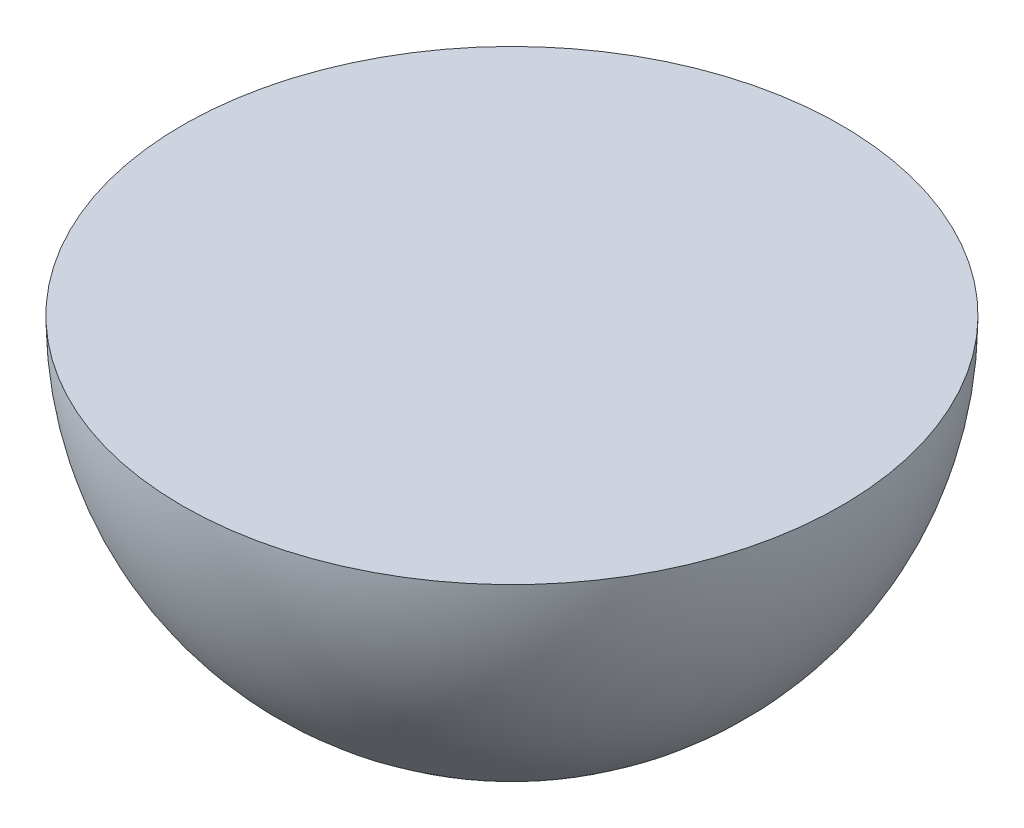
ISO-10303-21;
HEADER;
FILE_DESCRIPTION(('STEP AP214'),'2;1');
FILE_NAME('part.step','',(''),(''),'','','');
FILE_SCHEMA(('AUTOMOTIVE_DESIGN { 1 0 10303 214 1 1 1 1 }'));
ENDSEC;
DATA;
#1=APPLICATION_CONTEXT('core data for automotive mechanical design processes');
#2=APPLICATION_PROTOCOL_DEFINITION('international standard','automotive_design',2000,#1);
#3=PRODUCT_CONTEXT('',#1,'mechanical');
#4=PRODUCT('Part','Part','',(#3));
#5=PRODUCT_RELATED_PRODUCT_CATEGORY('part','',(#4));
#6=PRODUCT_DEFINITION_FORMATION('','',#4);
#7=PRODUCT_DEFINITION_CONTEXT('part definition',#1,'design');
#8=PRODUCT_DEFINITION('design','',#6,#7);
#9=PRODUCT_DEFINITION_SHAPE('','',#8);
#10=(LENGTH_UNIT() NAMED_UNIT(*) SI_UNIT(.MILLI.,.METRE.));
#11=(NAMED_UNIT(*) PLANE_ANGLE_UNIT() SI_UNIT($,.RADIAN.));
#12=(NAMED_UNIT(*) SI_UNIT($,.STERADIAN.) SOLID_ANGLE_UNIT());
#13=UNCERTAINTY_MEASURE_WITH_UNIT(LENGTH_MEASURE(1.E-05),#10,'distance_accuracy_value','');
#14=(GEOMETRIC_REPRESENTATION_CONTEXT(3) GLOBAL_UNCERTAINTY_ASSIGNED_CONTEXT((#13)) GLOBAL_UNIT_ASSIGNED_CONTEXT((#10,
#11,#12)) REPRESENTATION_CONTEXT('',''));
#15=CARTESIAN_POINT('',(0.,0.,0.));
#16=DIRECTION('',(0.,0.,1.));
#17=DIRECTION('',(1.,0.,0.));
#18=AXIS2_PLACEMENT_3D('',#15,#16,#17);
#19=CARTESIAN_POINT('',(0.,0.,0.));
#20=DIRECTION('',(0.,0.,-1.));
#21=DIRECTION('',(-1.,0.,0.));
#22=AXIS2_PLACEMENT_3D('',#19,#20,#21);
#23=SPHERICAL_SURFACE('',#22,71.755);
#24=CARTESIAN_POINT('',(0.,0.,0.));
#25=DIRECTION('',(0.,-1.,0.));
#26=DIRECTION('',(0.,0.,1.));
#27=AXIS2_PLACEMENT_3D('',#24,#25,#26);
#28=SPHERICAL_SURFACE('',#27,71.755);
#29=CARTESIAN_POINT('',(0.,0.,0.));
#30=DIRECTION('',(0.,-1.,0.));
#31=DIRECTION('',(0.,0.,1.));
#32=AXIS2_PLACEMENT_3D('',#29,#30,#31);
#33=CIRCLE('',#32,71.755);
#34=CARTESIAN_POINT('',(0.,0.,71.755));
#35=VERTEX_POINT('',#34);
#36=EDGE_CURVE('E10',#35,#35,#33,.T.);
#37=ORIENTED_EDGE('',*,*,#36,.T.);
#38=EDGE_LOOP('',(#37));
#39=FACE_BOUND('',#38,.T.);
#40=ADVANCED_FACE('F37',(#39),#28,.T.);
#41=CARTESIAN_POINT('',(0.,0.,0.));
#42=DIRECTION('',(0.,-1.,0.));
#43=DIRECTION('',(0.,0.,1.));
#44=AXIS2_PLACEMENT_3D('',#41,#42,#43);
#45=PLANE('',#44);
#46=ORIENTED_EDGE('',*,*,#36,.F.);
#47=EDGE_LOOP('',(#46));
#48=FACE_BOUND('',#47,.T.);
#49=ADVANCED_FACE('F45',(#48),#45,.F.);
#50=CLOSED_SHELL('',(#40,#49));
#51=MANIFOLD_SOLID_BREP('B2',#50);
#52=ADVANCED_BREP_SHAPE_REPRESENTATION('',(#18,#51),#14);
#53=SHAPE_DEFINITION_REPRESENTATION(#9,#52);
ENDSEC;
END-ISO-10303-21;
